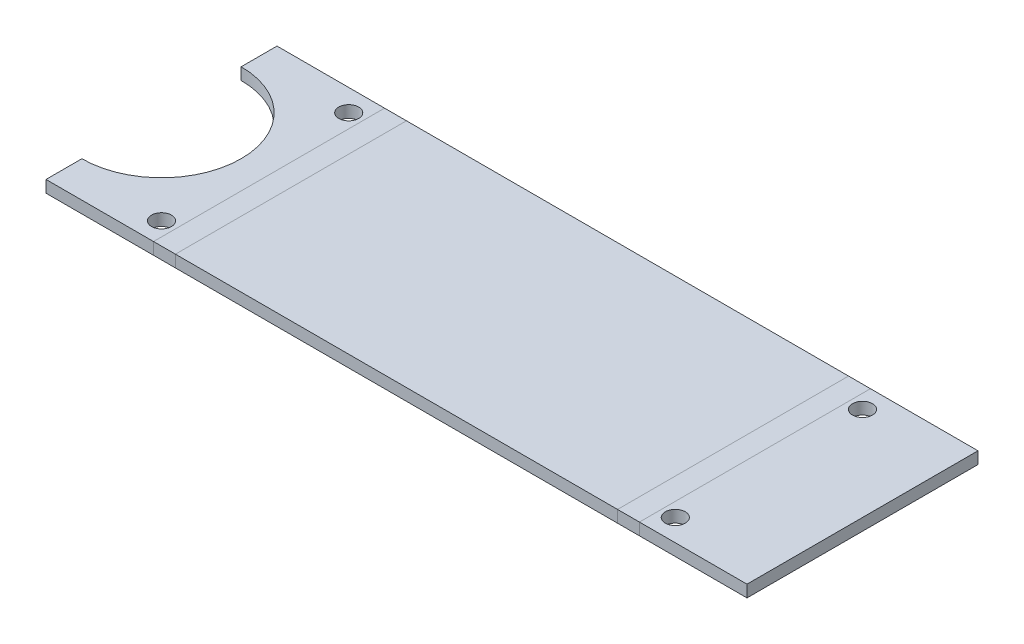
ISO-10303-21;
HEADER;
FILE_DESCRIPTION(('STEP AP214'),'2;1');
FILE_NAME('part.step','',(''),(''),'','','');
FILE_SCHEMA(('AUTOMOTIVE_DESIGN { 1 0 10303 214 1 1 1 1 }'));
ENDSEC;
DATA;
#1=APPLICATION_CONTEXT('core data for automotive mechanical design processes');
#2=APPLICATION_PROTOCOL_DEFINITION('international standard','automotive_design',2000,#1);
#3=PRODUCT_CONTEXT('',#1,'mechanical');
#4=PRODUCT('Part','Part','',(#3));
#5=PRODUCT_RELATED_PRODUCT_CATEGORY('part','',(#4));
#6=PRODUCT_DEFINITION_FORMATION('','',#4);
#7=PRODUCT_DEFINITION_CONTEXT('part definition',#1,'design');
#8=PRODUCT_DEFINITION('design','',#6,#7);
#9=PRODUCT_DEFINITION_SHAPE('','',#8);
#10=(LENGTH_UNIT() NAMED_UNIT(*) SI_UNIT(.MILLI.,.METRE.));
#11=(NAMED_UNIT(*) PLANE_ANGLE_UNIT() SI_UNIT($,.RADIAN.));
#12=(NAMED_UNIT(*) SI_UNIT($,.STERADIAN.) SOLID_ANGLE_UNIT());
#13=UNCERTAINTY_MEASURE_WITH_UNIT(LENGTH_MEASURE(1.E-05),#10,'distance_accuracy_value','');
#14=(GEOMETRIC_REPRESENTATION_CONTEXT(3) GLOBAL_UNCERTAINTY_ASSIGNED_CONTEXT((#13)) GLOBAL_UNIT_ASSIGNED_CONTEXT((#10,
#11,#12)) REPRESENTATION_CONTEXT('',''));
#15=CARTESIAN_POINT('',(0.,0.,0.));
#16=DIRECTION('',(0.,0.,1.));
#17=DIRECTION('',(1.,0.,0.));
#18=AXIS2_PLACEMENT_3D('',#15,#16,#17);
#19=CARTESIAN_POINT('',(0.,3.,0.));
#20=DIRECTION('',(0.,0.,-1.));
#21=DIRECTION('',(-1.,0.,0.));
#22=AXIS2_PLACEMENT_3D('',#19,#20,#21);
#23=PLANE('',#22);
#24=DIRECTION('',(0.,1.,0.));
#25=VECTOR('',#24,1.);
#26=CARTESIAN_POINT('',(116.,3.,0.));
#27=LINE('',#26,#25);
#28=CARTESIAN_POINT('',(116.,0.,0.));
#29=VERTEX_POINT('',#28);
#30=CARTESIAN_POINT('',(116.,3.,0.));
#31=VERTEX_POINT('',#30);
#32=EDGE_CURVE('E11',#29,#31,#27,.T.);
#33=ORIENTED_EDGE('',*,*,#32,.F.);
#34=DIRECTION('',(1.,0.,0.));
#35=VECTOR('',#34,1.);
#36=CARTESIAN_POINT('',(0.,0.,0.));
#37=LINE('',#36,#35);
#38=CARTESIAN_POINT('',(5.,0.,0.));
#39=VERTEX_POINT('',#38);
#40=EDGE_CURVE('E53',#29,#39,#37,.F.);
#41=ORIENTED_EDGE('',*,*,#40,.T.);
#42=DIRECTION('',(0.,1.,0.));
#43=VECTOR('',#42,1.);
#44=CARTESIAN_POINT('',(5.,3.,0.));
#45=LINE('',#44,#43);
#46=CARTESIAN_POINT('',(5.,3.,0.));
#47=VERTEX_POINT('',#46);
#48=EDGE_CURVE('E289',#39,#47,#45,.T.);
#49=ORIENTED_EDGE('',*,*,#48,.T.);
#50=DIRECTION('',(-1.,0.,0.));
#51=VECTOR('',#50,1.);
#52=CARTESIAN_POINT('',(0.,3.,0.));
#53=LINE('',#52,#51);
#54=EDGE_CURVE('E284',#31,#47,#53,.T.);
#55=ORIENTED_EDGE('',*,*,#54,.F.);
#56=EDGE_LOOP('',(#33,#41,#49,#55));
#57=FACE_BOUND('',#56,.T.);
#58=ADVANCED_FACE('F39',(#57),#23,.T.);
#59=CARTESIAN_POINT('',(0.,3.,58.));
#60=DIRECTION('',(0.,0.,1.));
#61=DIRECTION('',(1.,0.,0.));
#62=AXIS2_PLACEMENT_3D('',#59,#60,#61);
#63=PLANE('',#62);
#64=DIRECTION('',(0.,1.,0.));
#65=VECTOR('',#64,1.);
#66=CARTESIAN_POINT('',(5.,3.,58.));
#67=LINE('',#66,#65);
#68=CARTESIAN_POINT('',(5.,0.,58.));
#69=VERTEX_POINT('',#68);
#70=CARTESIAN_POINT('',(5.,3.,58.));
#71=VERTEX_POINT('',#70);
#72=EDGE_CURVE('E295',#69,#71,#67,.T.);
#73=ORIENTED_EDGE('',*,*,#72,.F.);
#74=DIRECTION('',(1.,0.,0.));
#75=VECTOR('',#74,1.);
#76=CARTESIAN_POINT('',(0.,0.,58.));
#77=LINE('',#76,#75);
#78=CARTESIAN_POINT('',(116.,0.,58.));
#79=VERTEX_POINT('',#78);
#80=EDGE_CURVE('E61',#69,#79,#77,.T.);
#81=ORIENTED_EDGE('',*,*,#80,.T.);
#82=DIRECTION('',(0.,1.,0.));
#83=VECTOR('',#82,1.);
#84=CARTESIAN_POINT('',(116.,3.,58.));
#85=LINE('',#84,#83);
#86=CARTESIAN_POINT('',(116.,3.,58.));
#87=VERTEX_POINT('',#86);
#88=EDGE_CURVE('E300',#79,#87,#85,.T.);
#89=ORIENTED_EDGE('',*,*,#88,.T.);
#90=DIRECTION('',(1.,0.,0.));
#91=VECTOR('',#90,1.);
#92=CARTESIAN_POINT('',(0.,3.,58.));
#93=LINE('',#92,#91);
#94=EDGE_CURVE('E282',#71,#87,#93,.T.);
#95=ORIENTED_EDGE('',*,*,#94,.F.);
#96=EDGE_LOOP('',(#73,#81,#89,#95));
#97=FACE_BOUND('',#96,.T.);
#98=ADVANCED_FACE('F324',(#97),#63,.T.);
#99=CARTESIAN_POINT('',(0.,3.,0.));
#100=DIRECTION('',(0.,1.,0.));
#101=DIRECTION('',(0.,0.,1.));
#102=AXIS2_PLACEMENT_3D('',#99,#100,#101);
#103=PLANE('',#102);
#104=ORIENTED_EDGE('',*,*,#54,.T.);
#105=DIRECTION('',(0.,0.,1.));
#106=VECTOR('',#105,1.);
#107=CARTESIAN_POINT('',(5.,3.,0.));
#108=LINE('',#107,#106);
#109=EDGE_CURVE('E287',#47,#71,#108,.T.);
#110=ORIENTED_EDGE('',*,*,#109,.T.);
#111=ORIENTED_EDGE('',*,*,#94,.T.);
#112=DIRECTION('',(0.,0.,-1.));
#113=VECTOR('',#112,1.);
#114=CARTESIAN_POINT('',(116.,3.,0.));
#115=LINE('',#114,#113);
#116=EDGE_CURVE('E298',#87,#31,#115,.T.);
#117=ORIENTED_EDGE('',*,*,#116,.T.);
#118=EDGE_LOOP('',(#104,#110,#111,#117));
#119=FACE_BOUND('',#118,.T.);
#120=ADVANCED_FACE('F327',(#119),#103,.T.);
#121=CARTESIAN_POINT('',(0.,0.,0.));
#122=DIRECTION('',(0.,1.,0.));
#123=DIRECTION('',(0.,0.,1.));
#124=AXIS2_PLACEMENT_3D('',#121,#122,#123);
#125=PLANE('',#124);
#126=ORIENTED_EDGE('',*,*,#40,.F.);
#127=DIRECTION('',(0.,0.,-1.));
#128=VECTOR('',#127,1.);
#129=CARTESIAN_POINT('',(116.,0.,0.));
#130=LINE('',#129,#128);
#131=EDGE_CURVE('E46',#79,#29,#130,.T.);
#132=ORIENTED_EDGE('',*,*,#131,.F.);
#133=ORIENTED_EDGE('',*,*,#80,.F.);
#134=DIRECTION('',(0.,0.,1.));
#135=VECTOR('',#134,1.);
#136=CARTESIAN_POINT('',(5.,0.,0.));
#137=LINE('',#136,#135);
#138=EDGE_CURVE('E292',#39,#69,#137,.T.);
#139=ORIENTED_EDGE('',*,*,#138,.F.);
#140=EDGE_LOOP('',(#126,#132,#133,#139));
#141=FACE_BOUND('',#140,.T.);
#142=ADVANCED_FACE('F372',(#141),#125,.F.);
#143=CARTESIAN_POINT('',(-0.497787143782165,3.,58.));
#144=DIRECTION('',(0.,0.,1.));
#145=DIRECTION('',(1.,0.,0.));
#146=AXIS2_PLACEMENT_3D('',#143,#144,#145);
#147=PLANE('',#146);
#148=DIRECTION('',(0.,1.,0.));
#149=VECTOR('',#148,1.);
#150=CARTESIAN_POINT('',(-0.497787143782138,3.,58.));
#151=LINE('',#150,#149);
#152=CARTESIAN_POINT('',(-0.497787143782138,0.,58.));
#153=VERTEX_POINT('',#152);
#154=CARTESIAN_POINT('',(-0.497787143782138,3.,58.));
#155=VERTEX_POINT('',#154);
#156=EDGE_CURVE('E206',#153,#155,#151,.T.);
#157=ORIENTED_EDGE('',*,*,#156,.F.);
#158=DIRECTION('',(1.,0.,0.));
#159=VECTOR('',#158,1.);
#160=CARTESIAN_POINT('',(2.25110642810893,0.,58.));
#161=LINE('',#160,#159);
#162=EDGE_CURVE('E209',#153,#69,#161,.T.);
#163=ORIENTED_EDGE('',*,*,#162,.T.);
#164=ORIENTED_EDGE('',*,*,#72,.T.);
#165=DIRECTION('',(1.,0.,0.));
#166=VECTOR('',#165,1.);
#167=CARTESIAN_POINT('',(-0.497787143782165,3.,58.));
#168=LINE('',#167,#166);
#169=EDGE_CURVE('E266',#155,#71,#168,.T.);
#170=ORIENTED_EDGE('',*,*,#169,.F.);
#171=EDGE_LOOP('',(#157,#163,#164,#170));
#172=FACE_BOUND('',#171,.T.);
#173=ADVANCED_FACE('F369',(#172),#147,.T.);
#174=CARTESIAN_POINT('',(5.,3.,0.));
#175=DIRECTION('',(0.,0.,-1.));
#176=DIRECTION('',(-1.,0.,0.));
#177=AXIS2_PLACEMENT_3D('',#174,#175,#176);
#178=PLANE('',#177);
#179=ORIENTED_EDGE('',*,*,#48,.F.);
#180=DIRECTION('',(1.,0.,0.));
#181=VECTOR('',#180,1.);
#182=CARTESIAN_POINT('',(2.25110642810893,0.,0.));
#183=LINE('',#182,#181);
#184=CARTESIAN_POINT('',(-0.497787143782148,0.,0.));
#185=VERTEX_POINT('',#184);
#186=EDGE_CURVE('E270',#39,#185,#183,.F.);
#187=ORIENTED_EDGE('',*,*,#186,.T.);
#188=DIRECTION('',(0.,1.,0.));
#189=VECTOR('',#188,1.);
#190=CARTESIAN_POINT('',(-0.497787143782138,3.,0.));
#191=LINE('',#190,#189);
#192=CARTESIAN_POINT('',(-0.497787143782165,3.,0.));
#193=VERTEX_POINT('',#192);
#194=EDGE_CURVE('E261',#185,#193,#191,.T.);
#195=ORIENTED_EDGE('',*,*,#194,.T.);
#196=DIRECTION('',(-1.,0.,0.));
#197=VECTOR('',#196,1.);
#198=CARTESIAN_POINT('',(5.,3.,0.));
#199=LINE('',#198,#197);
#200=EDGE_CURVE('E269',#47,#193,#199,.T.);
#201=ORIENTED_EDGE('',*,*,#200,.F.);
#202=EDGE_LOOP('',(#179,#187,#195,#201));
#203=FACE_BOUND('',#202,.T.);
#204=ADVANCED_FACE('F338',(#203),#178,.T.);
#205=CARTESIAN_POINT('',(2.25110642810893,3.,29.));
#206=DIRECTION('',(0.,1.,0.));
#207=DIRECTION('',(0.,0.,1.));
#208=AXIS2_PLACEMENT_3D('',#205,#206,#207);
#209=PLANE('',#208);
#210=ORIENTED_EDGE('',*,*,#200,.T.);
#211=DIRECTION('',(0.,0.,-1.));
#212=VECTOR('',#211,1.);
#213=CARTESIAN_POINT('',(-0.497787143782131,3.,0.));
#214=LINE('',#213,#212);
#215=EDGE_CURVE('E230',#155,#193,#214,.T.);
#216=ORIENTED_EDGE('',*,*,#215,.F.);
#217=ORIENTED_EDGE('',*,*,#169,.T.);
#218=ORIENTED_EDGE('',*,*,#109,.F.);
#219=EDGE_LOOP('',(#210,#216,#217,#218));
#220=FACE_BOUND('',#219,.T.);
#221=ADVANCED_FACE('F335',(#220),#209,.T.);
#222=CARTESIAN_POINT('',(2.25110642810893,0.,29.));
#223=DIRECTION('',(0.,1.,0.));
#224=DIRECTION('',(0.,0.,1.));
#225=AXIS2_PLACEMENT_3D('',#222,#223,#224);
#226=PLANE('',#225);
#227=ORIENTED_EDGE('',*,*,#186,.F.);
#228=ORIENTED_EDGE('',*,*,#138,.T.);
#229=ORIENTED_EDGE('',*,*,#162,.F.);
#230=DIRECTION('',(0.,0.,-1.));
#231=VECTOR('',#230,1.);
#232=CARTESIAN_POINT('',(-0.497787143782138,0.,0.));
#233=LINE('',#232,#231);
#234=EDGE_CURVE('E201',#153,#185,#233,.T.);
#235=ORIENTED_EDGE('',*,*,#234,.T.);
#236=EDGE_LOOP('',(#227,#228,#229,#235));
#237=FACE_BOUND('',#236,.T.);
#238=ADVANCED_FACE('F371',(#237),#226,.F.);
#239=CARTESIAN_POINT('',(-27.4977871437821,3.,0.));
#240=DIRECTION('',(-1.,0.,0.));
#241=DIRECTION('',(0.,0.,-1.));
#242=AXIS2_PLACEMENT_3D('',#239,#240,#241);
#243=PLANE('',#242);
#244=DIRECTION('',(0.,1.,0.));
#245=VECTOR('',#244,1.);
#246=CARTESIAN_POINT('',(-27.4977871437821,3.00000000000001,49.));
#247=LINE('',#246,#245);
#248=CARTESIAN_POINT('',(-27.4977871437821,0.,49.));
#249=VERTEX_POINT('',#248);
#250=CARTESIAN_POINT('',(-27.4977871437821,3.00000000000001,49.));
#251=VERTEX_POINT('',#250);
#252=EDGE_CURVE('E254',#249,#251,#247,.T.);
#253=ORIENTED_EDGE('',*,*,#252,.F.);
#254=DIRECTION('',(0.,0.,1.));
#255=VECTOR('',#254,1.);
#256=CARTESIAN_POINT('',(-27.4977871437821,0.,0.));
#257=LINE('',#256,#255);
#258=CARTESIAN_POINT('',(-27.4977871437821,0.,58.));
#259=VERTEX_POINT('',#258);
#260=EDGE_CURVE('E217',#259,#249,#257,.F.);
#261=ORIENTED_EDGE('',*,*,#260,.F.);
#262=DIRECTION('',(0.,1.,0.));
#263=VECTOR('',#262,1.);
#264=CARTESIAN_POINT('',(-27.4977871437821,3.,58.));
#265=LINE('',#264,#263);
#266=CARTESIAN_POINT('',(-27.4977871437821,3.,58.));
#267=VERTEX_POINT('',#266);
#268=EDGE_CURVE('E259',#259,#267,#265,.T.);
#269=ORIENTED_EDGE('',*,*,#268,.T.);
#270=DIRECTION('',(0.,0.,-1.));
#271=VECTOR('',#270,1.);
#272=CARTESIAN_POINT('',(-27.4977871437821,3.,0.));
#273=LINE('',#272,#271);
#274=EDGE_CURVE('E252',#267,#251,#273,.T.);
#275=ORIENTED_EDGE('',*,*,#274,.T.);
#276=EDGE_LOOP('',(#253,#261,#269,#275));
#277=FACE_BOUND('',#276,.T.);
#278=ADVANCED_FACE('F360',(#277),#243,.T.);
#279=CARTESIAN_POINT('',(-27.4977871437821,3.,29.));
#280=DIRECTION('',(0.,-1.,0.));
#281=DIRECTION('',(0.,0.,1.));
#282=AXIS2_PLACEMENT_3D('',#279,#280,#281);
#283=CYLINDRICAL_SURFACE('',#282,20.);
#284=DIRECTION('',(0.,1.,0.));
#285=VECTOR('',#284,1.);
#286=CARTESIAN_POINT('',(-27.4977871437821,3.00000000000001,9.));
#287=LINE('',#286,#285);
#288=CARTESIAN_POINT('',(-27.4977871437821,0.,9.));
#289=VERTEX_POINT('',#288);
#290=CARTESIAN_POINT('',(-27.4977871437821,3.00000000000001,9.));
#291=VERTEX_POINT('',#290);
#292=EDGE_CURVE('E251',#289,#291,#287,.T.);
#293=ORIENTED_EDGE('',*,*,#292,.F.);
#294=CARTESIAN_POINT('',(-27.4977871437821,0.,29.));
#295=DIRECTION('',(0.,-1.,0.));
#296=DIRECTION('',(0.,0.,1.));
#297=AXIS2_PLACEMENT_3D('',#294,#295,#296);
#298=CIRCLE('',#297,20.);
#299=EDGE_CURVE('E256',#289,#249,#298,.T.);
#300=ORIENTED_EDGE('',*,*,#299,.T.);
#301=ORIENTED_EDGE('',*,*,#252,.T.);
#302=CARTESIAN_POINT('',(-27.4977871437821,3.,29.));
#303=DIRECTION('',(0.,-1.,0.));
#304=DIRECTION('',(0.,0.,1.));
#305=AXIS2_PLACEMENT_3D('',#302,#303,#304);
#306=CIRCLE('',#305,20.);
#307=EDGE_CURVE('E227',#291,#251,#306,.T.);
#308=ORIENTED_EDGE('',*,*,#307,.F.);
#309=EDGE_LOOP('',(#293,#300,#301,#308));
#310=FACE_BOUND('',#309,.T.);
#311=ADVANCED_FACE('F353',(#310),#283,.F.);
#312=DIRECTION('',(0.,1.,0.));
#313=VECTOR('',#312,1.);
#314=CARTESIAN_POINT('',(-27.4977871437821,3.,0.));
#315=LINE('',#314,#313);
#316=CARTESIAN_POINT('',(-27.4977871437821,0.,0.));
#317=VERTEX_POINT('',#316);
#318=CARTESIAN_POINT('',(-27.4977871437821,3.,0.));
#319=VERTEX_POINT('',#318);
#320=EDGE_CURVE('E223',#317,#319,#315,.T.);
#321=ORIENTED_EDGE('',*,*,#320,.F.);
#322=DIRECTION('',(0.,0.,1.));
#323=VECTOR('',#322,1.);
#324=CARTESIAN_POINT('',(-27.4977871437821,0.,0.));
#325=LINE('',#324,#323);
#326=EDGE_CURVE('E214',#289,#317,#325,.F.);
#327=ORIENTED_EDGE('',*,*,#326,.F.);
#328=ORIENTED_EDGE('',*,*,#292,.T.);
#329=EDGE_CURVE('E248',#291,#319,#273,.T.);
#330=ORIENTED_EDGE('',*,*,#329,.T.);
#331=EDGE_LOOP('',(#321,#327,#328,#330));
#332=FACE_BOUND('',#331,.T.);
#333=ADVANCED_FACE('F349',(#332),#243,.T.);
#334=CARTESIAN_POINT('',(-3.99778714378213,3.,5.5));
#335=DIRECTION('',(0.,-1.,0.));
#336=DIRECTION('',(0.,0.,1.));
#337=AXIS2_PLACEMENT_3D('',#334,#335,#336);
#338=CYLINDRICAL_SURFACE('',#337,2.5);
#339=CARTESIAN_POINT('',(-3.99778714378213,3.,5.5));
#340=DIRECTION('',(0.,-1.,0.));
#341=DIRECTION('',(0.,0.,1.));
#342=AXIS2_PLACEMENT_3D('',#339,#340,#341);
#343=CIRCLE('',#342,2.5);
#344=CARTESIAN_POINT('',(-3.99778714378213,3.,8.));
#345=VERTEX_POINT('',#344);
#346=EDGE_CURVE('E234',#345,#345,#343,.T.);
#347=ORIENTED_EDGE('',*,*,#346,.F.);
#348=EDGE_LOOP('',(#347));
#349=FACE_BOUND('',#348,.T.);
#350=CARTESIAN_POINT('',(-3.99778714378213,0.,5.5));
#351=DIRECTION('',(0.,-1.,0.));
#352=DIRECTION('',(0.,0.,1.));
#353=AXIS2_PLACEMENT_3D('',#350,#351,#352);
#354=CIRCLE('',#353,2.5);
#355=CARTESIAN_POINT('',(-3.99778714378213,0.,8.));
#356=VERTEX_POINT('',#355);
#357=EDGE_CURVE('E245',#356,#356,#354,.T.);
#358=ORIENTED_EDGE('',*,*,#357,.T.);
#359=EDGE_LOOP('',(#358));
#360=FACE_BOUND('',#359,.T.);
#361=ADVANCED_FACE('F428',(#349,#360),#338,.F.);
#362=CARTESIAN_POINT('',(-3.99778714378213,3.,52.5));
#363=DIRECTION('',(0.,-1.,0.));
#364=DIRECTION('',(0.,0.,1.));
#365=AXIS2_PLACEMENT_3D('',#362,#363,#364);
#366=CYLINDRICAL_SURFACE('',#365,2.5);
#367=CARTESIAN_POINT('',(-3.99778714378213,3.,52.5));
#368=DIRECTION('',(0.,-1.,0.));
#369=DIRECTION('',(0.,0.,1.));
#370=AXIS2_PLACEMENT_3D('',#367,#368,#369);
#371=CIRCLE('',#370,2.5);
#372=CARTESIAN_POINT('',(-3.99778714378213,3.,55.));
#373=VERTEX_POINT('',#372);
#374=EDGE_CURVE('E239',#373,#373,#371,.T.);
#375=ORIENTED_EDGE('',*,*,#374,.F.);
#376=EDGE_LOOP('',(#375));
#377=FACE_BOUND('',#376,.T.);
#378=CARTESIAN_POINT('',(-3.99778714378213,0.,52.5));
#379=DIRECTION('',(0.,-1.,0.));
#380=DIRECTION('',(0.,0.,1.));
#381=AXIS2_PLACEMENT_3D('',#378,#379,#380);
#382=CIRCLE('',#381,2.5);
#383=CARTESIAN_POINT('',(-3.99778714378213,0.,55.));
#384=VERTEX_POINT('',#383);
#385=EDGE_CURVE('E242',#384,#384,#382,.T.);
#386=ORIENTED_EDGE('',*,*,#385,.T.);
#387=EDGE_LOOP('',(#386));
#388=FACE_BOUND('',#387,.T.);
#389=ADVANCED_FACE('F437',(#377,#388),#366,.F.);
#390=CARTESIAN_POINT('',(-27.4977871437821,3.,0.));
#391=DIRECTION('',(0.,-1.,0.));
#392=DIRECTION('',(0.,0.,1.));
#393=AXIS2_PLACEMENT_3D('',#390,#391,#392);
#394=PLANE('',#393);
#395=ORIENTED_EDGE('',*,*,#374,.T.);
#396=EDGE_LOOP('',(#395));
#397=FACE_BOUND('',#396,.T.);
#398=ORIENTED_EDGE('',*,*,#346,.T.);
#399=EDGE_LOOP('',(#398));
#400=FACE_BOUND('',#399,.T.);
#401=DIRECTION('',(1.,0.,0.));
#402=VECTOR('',#401,1.);
#403=CARTESIAN_POINT('',(-27.4977871437821,3.,58.));
#404=LINE('',#403,#402);
#405=EDGE_CURVE('E232',#267,#155,#404,.T.);
#406=ORIENTED_EDGE('',*,*,#405,.T.);
#407=ORIENTED_EDGE('',*,*,#215,.T.);
#408=DIRECTION('',(1.,0.,0.));
#409=VECTOR('',#408,1.);
#410=CARTESIAN_POINT('',(-27.4977871437821,3.,0.));
#411=LINE('',#410,#409);
#412=EDGE_CURVE('E220',#319,#193,#411,.T.);
#413=ORIENTED_EDGE('',*,*,#412,.F.);
#414=ORIENTED_EDGE('',*,*,#329,.F.);
#415=ORIENTED_EDGE('',*,*,#307,.T.);
#416=ORIENTED_EDGE('',*,*,#274,.F.);
#417=EDGE_LOOP('',(#406,#407,#413,#414,#415,#416));
#418=FACE_BOUND('',#417,.T.);
#419=ADVANCED_FACE('F346',(#397,#400,#418),#394,.F.);
#420=CARTESIAN_POINT('',(-27.4977871437821,3.,0.));
#421=DIRECTION('',(0.,0.,-1.));
#422=DIRECTION('',(1.,0.,0.));
#423=AXIS2_PLACEMENT_3D('',#420,#421,#422);
#424=PLANE('',#423);
#425=ORIENTED_EDGE('',*,*,#194,.F.);
#426=DIRECTION('',(-1.,0.,0.));
#427=VECTOR('',#426,1.);
#428=CARTESIAN_POINT('',(-27.4977871437821,0.,0.));
#429=LINE('',#428,#427);
#430=EDGE_CURVE('E212',#317,#185,#429,.F.);
#431=ORIENTED_EDGE('',*,*,#430,.F.);
#432=ORIENTED_EDGE('',*,*,#320,.T.);
#433=ORIENTED_EDGE('',*,*,#412,.T.);
#434=EDGE_LOOP('',(#425,#431,#432,#433));
#435=FACE_BOUND('',#434,.T.);
#436=ADVANCED_FACE('F342',(#435),#424,.T.);
#437=CARTESIAN_POINT('',(-27.4977871437821,0.,0.));
#438=DIRECTION('',(0.,-1.,0.));
#439=DIRECTION('',(0.,0.,1.));
#440=AXIS2_PLACEMENT_3D('',#437,#438,#439);
#441=PLANE('',#440);
#442=ORIENTED_EDGE('',*,*,#385,.F.);
#443=EDGE_LOOP('',(#442));
#444=FACE_BOUND('',#443,.T.);
#445=ORIENTED_EDGE('',*,*,#357,.F.);
#446=EDGE_LOOP('',(#445));
#447=FACE_BOUND('',#446,.T.);
#448=DIRECTION('',(-1.,0.,0.));
#449=VECTOR('',#448,1.);
#450=CARTESIAN_POINT('',(-27.4977871437821,0.,58.));
#451=LINE('',#450,#449);
#452=EDGE_CURVE('E210',#259,#153,#451,.F.);
#453=ORIENTED_EDGE('',*,*,#452,.F.);
#454=ORIENTED_EDGE('',*,*,#260,.T.);
#455=ORIENTED_EDGE('',*,*,#299,.F.);
#456=ORIENTED_EDGE('',*,*,#326,.T.);
#457=ORIENTED_EDGE('',*,*,#430,.T.);
#458=ORIENTED_EDGE('',*,*,#234,.F.);
#459=EDGE_LOOP('',(#453,#454,#455,#456,#457,#458));
#460=FACE_BOUND('',#459,.T.);
#461=ADVANCED_FACE('F356',(#444,#447,#460),#441,.T.);
#462=CARTESIAN_POINT('',(-27.4977871437821,3.,58.));
#463=DIRECTION('',(0.,0.,-1.));
#464=DIRECTION('',(1.,0.,0.));
#465=AXIS2_PLACEMENT_3D('',#462,#463,#464);
#466=PLANE('',#465);
#467=ORIENTED_EDGE('',*,*,#268,.F.);
#468=ORIENTED_EDGE('',*,*,#452,.T.);
#469=ORIENTED_EDGE('',*,*,#156,.T.);
#470=ORIENTED_EDGE('',*,*,#405,.F.);
#471=EDGE_LOOP('',(#467,#468,#469,#470));
#472=FACE_BOUND('',#471,.T.);
#473=ADVANCED_FACE('F365',(#472),#466,.F.);
#474=CARTESIAN_POINT('',(121.497787143782,3.,0.));
#475=DIRECTION('',(0.,0.,-1.));
#476=DIRECTION('',(-1.,0.,0.));
#477=AXIS2_PLACEMENT_3D('',#474,#475,#476);
#478=PLANE('',#477);
#479=DIRECTION('',(0.,1.,0.));
#480=VECTOR('',#479,1.);
#481=CARTESIAN_POINT('',(121.497787143782,3.,0.));
#482=LINE('',#481,#480);
#483=CARTESIAN_POINT('',(121.497787143782,0.,0.));
#484=VERTEX_POINT('',#483);
#485=CARTESIAN_POINT('',(121.497787143782,3.,0.));
#486=VERTEX_POINT('',#485);
#487=EDGE_CURVE('E166',#484,#486,#482,.T.);
#488=ORIENTED_EDGE('',*,*,#487,.F.);
#489=DIRECTION('',(1.,0.,0.));
#490=VECTOR('',#489,1.);
#491=CARTESIAN_POINT('',(118.748893571891,0.,0.));
#492=LINE('',#491,#490);
#493=EDGE_CURVE('E168',#484,#29,#492,.F.);
#494=ORIENTED_EDGE('',*,*,#493,.T.);
#495=ORIENTED_EDGE('',*,*,#32,.T.);
#496=DIRECTION('',(-1.,0.,0.));
#497=VECTOR('',#496,1.);
#498=CARTESIAN_POINT('',(121.497787143782,3.,0.));
#499=LINE('',#498,#497);
#500=EDGE_CURVE('E194',#486,#31,#499,.T.);
#501=ORIENTED_EDGE('',*,*,#500,.F.);
#502=EDGE_LOOP('',(#488,#494,#495,#501));
#503=FACE_BOUND('',#502,.T.);
#504=ADVANCED_FACE('F308',(#503),#478,.T.);
#505=CARTESIAN_POINT('',(116.,3.,58.));
#506=DIRECTION('',(0.,0.,1.));
#507=DIRECTION('',(1.,0.,0.));
#508=AXIS2_PLACEMENT_3D('',#505,#506,#507);
#509=PLANE('',#508);
#510=ORIENTED_EDGE('',*,*,#88,.F.);
#511=DIRECTION('',(1.,0.,0.));
#512=VECTOR('',#511,1.);
#513=CARTESIAN_POINT('',(118.748893571891,0.,58.));
#514=LINE('',#513,#512);
#515=CARTESIAN_POINT('',(121.497787143782,0.,58.));
#516=VERTEX_POINT('',#515);
#517=EDGE_CURVE('E198',#79,#516,#514,.T.);
#518=ORIENTED_EDGE('',*,*,#517,.T.);
#519=DIRECTION('',(0.,1.,0.));
#520=VECTOR('',#519,1.);
#521=CARTESIAN_POINT('',(121.497787143782,3.,58.));
#522=LINE('',#521,#520);
#523=CARTESIAN_POINT('',(121.497787143782,3.,58.));
#524=VERTEX_POINT('',#523);
#525=EDGE_CURVE('E151',#516,#524,#522,.T.);
#526=ORIENTED_EDGE('',*,*,#525,.T.);
#527=DIRECTION('',(1.,0.,0.));
#528=VECTOR('',#527,1.);
#529=CARTESIAN_POINT('',(116.,3.,58.));
#530=LINE('',#529,#528);
#531=EDGE_CURVE('E197',#87,#524,#530,.T.);
#532=ORIENTED_EDGE('',*,*,#531,.F.);
#533=EDGE_LOOP('',(#510,#518,#526,#532));
#534=FACE_BOUND('',#533,.T.);
#535=ADVANCED_FACE('F322',(#534),#509,.T.);
#536=CARTESIAN_POINT('',(118.748893571891,3.,29.));
#537=DIRECTION('',(0.,1.,0.));
#538=DIRECTION('',(0.,0.,1.));
#539=AXIS2_PLACEMENT_3D('',#536,#537,#538);
#540=PLANE('',#539);
#541=ORIENTED_EDGE('',*,*,#531,.T.);
#542=DIRECTION('',(0.,0.,1.));
#543=VECTOR('',#542,1.);
#544=CARTESIAN_POINT('',(121.497787143782,3.,0.));
#545=LINE('',#544,#543);
#546=EDGE_CURVE('E175',#486,#524,#545,.T.);
#547=ORIENTED_EDGE('',*,*,#546,.F.);
#548=ORIENTED_EDGE('',*,*,#500,.T.);
#549=ORIENTED_EDGE('',*,*,#116,.F.);
#550=EDGE_LOOP('',(#541,#547,#548,#549));
#551=FACE_BOUND('',#550,.T.);
#552=ADVANCED_FACE('F313',(#551),#540,.T.);
#553=CARTESIAN_POINT('',(118.748893571891,0.,29.));
#554=DIRECTION('',(0.,1.,0.));
#555=DIRECTION('',(0.,0.,1.));
#556=AXIS2_PLACEMENT_3D('',#553,#554,#555);
#557=PLANE('',#556);
#558=ORIENTED_EDGE('',*,*,#517,.F.);
#559=ORIENTED_EDGE('',*,*,#131,.T.);
#560=ORIENTED_EDGE('',*,*,#493,.F.);
#561=DIRECTION('',(0.,0.,1.));
#562=VECTOR('',#561,1.);
#563=CARTESIAN_POINT('',(121.497787143782,0.,0.));
#564=LINE('',#563,#562);
#565=EDGE_CURVE('E164',#484,#516,#564,.T.);
#566=ORIENTED_EDGE('',*,*,#565,.T.);
#567=EDGE_LOOP('',(#558,#559,#560,#566));
#568=FACE_BOUND('',#567,.T.);
#569=ADVANCED_FACE('F305',(#568),#557,.F.);
#570=CARTESIAN_POINT('',(148.497787143782,3.,0.));
#571=DIRECTION('',(1.,0.,0.));
#572=DIRECTION('',(0.,0.,1.));
#573=AXIS2_PLACEMENT_3D('',#570,#571,#572);
#574=PLANE('',#573);
#575=DIRECTION('',(0.,1.,0.));
#576=VECTOR('',#575,1.);
#577=CARTESIAN_POINT('',(148.497787143782,3.,58.));
#578=LINE('',#577,#576);
#579=CARTESIAN_POINT('',(148.497787143782,0.,58.));
#580=VERTEX_POINT('',#579);
#581=CARTESIAN_POINT('',(148.497787143782,3.,58.));
#582=VERTEX_POINT('',#581);
#583=EDGE_CURVE('E156',#580,#582,#578,.T.);
#584=ORIENTED_EDGE('',*,*,#583,.F.);
#585=DIRECTION('',(0.,0.,-1.));
#586=VECTOR('',#585,1.);
#587=CARTESIAN_POINT('',(148.497787143782,0.,0.));
#588=LINE('',#587,#586);
#589=CARTESIAN_POINT('',(148.497787143782,0.,0.));
#590=VERTEX_POINT('',#589);
#591=EDGE_CURVE('E154',#590,#580,#588,.F.);
#592=ORIENTED_EDGE('',*,*,#591,.F.);
#593=DIRECTION('',(0.,1.,0.));
#594=VECTOR('',#593,1.);
#595=CARTESIAN_POINT('',(148.497787143782,3.,0.));
#596=LINE('',#595,#594);
#597=CARTESIAN_POINT('',(148.497787143782,3.,0.));
#598=VERTEX_POINT('',#597);
#599=EDGE_CURVE('E139',#590,#598,#596,.T.);
#600=ORIENTED_EDGE('',*,*,#599,.T.);
#601=DIRECTION('',(0.,0.,1.));
#602=VECTOR('',#601,1.);
#603=CARTESIAN_POINT('',(148.497787143782,3.,0.));
#604=LINE('',#603,#602);
#605=EDGE_CURVE('E150',#598,#582,#604,.T.);
#606=ORIENTED_EDGE('',*,*,#605,.T.);
#607=EDGE_LOOP('',(#584,#592,#600,#606));
#608=FACE_BOUND('',#607,.T.);
#609=ADVANCED_FACE('F155',(#608),#574,.T.);
#610=CARTESIAN_POINT('',(124.997787143782,3.,52.5));
#611=DIRECTION('',(0.,-1.,0.));
#612=DIRECTION('',(0.,0.,-1.));
#613=AXIS2_PLACEMENT_3D('',#610,#611,#612);
#614=CYLINDRICAL_SURFACE('',#613,2.5);
#615=CARTESIAN_POINT('',(124.997787143782,3.,52.5));
#616=DIRECTION('',(0.,-1.,0.));
#617=DIRECTION('',(0.,0.,-1.));
#618=AXIS2_PLACEMENT_3D('',#615,#616,#617);
#619=CIRCLE('',#618,2.5);
#620=CARTESIAN_POINT('',(124.997787143782,3.,50.));
#621=VERTEX_POINT('',#620);
#622=EDGE_CURVE('E178',#621,#621,#619,.T.);
#623=ORIENTED_EDGE('',*,*,#622,.F.);
#624=EDGE_LOOP('',(#623));
#625=FACE_BOUND('',#624,.T.);
#626=CARTESIAN_POINT('',(124.997787143782,0.,52.5));
#627=DIRECTION('',(0.,-1.,0.));
#628=DIRECTION('',(0.,0.,-1.));
#629=AXIS2_PLACEMENT_3D('',#626,#627,#628);
#630=CIRCLE('',#629,2.5);
#631=CARTESIAN_POINT('',(124.997787143782,0.,50.));
#632=VERTEX_POINT('',#631);
#633=EDGE_CURVE('E187',#632,#632,#630,.T.);
#634=ORIENTED_EDGE('',*,*,#633,.T.);
#635=EDGE_LOOP('',(#634));
#636=FACE_BOUND('',#635,.T.);
#637=ADVANCED_FACE('F497',(#625,#636),#614,.F.);
#638=CARTESIAN_POINT('',(124.997787143782,3.,5.50000000000002));
#639=DIRECTION('',(0.,-1.,0.));
#640=DIRECTION('',(0.,0.,-1.));
#641=AXIS2_PLACEMENT_3D('',#638,#639,#640);
#642=CYLINDRICAL_SURFACE('',#641,2.5);
#643=CARTESIAN_POINT('',(124.997787143782,3.,5.50000000000002));
#644=DIRECTION('',(0.,-1.,0.));
#645=DIRECTION('',(0.,0.,-1.));
#646=AXIS2_PLACEMENT_3D('',#643,#644,#645);
#647=CIRCLE('',#646,2.5);
#648=CARTESIAN_POINT('',(124.997787143782,3.,3.00000000000002));
#649=VERTEX_POINT('',#648);
#650=EDGE_CURVE('E181',#649,#649,#647,.T.);
#651=ORIENTED_EDGE('',*,*,#650,.F.);
#652=EDGE_LOOP('',(#651));
#653=FACE_BOUND('',#652,.T.);
#654=CARTESIAN_POINT('',(124.997787143782,0.,5.50000000000002));
#655=DIRECTION('',(0.,-1.,0.));
#656=DIRECTION('',(0.,0.,-1.));
#657=AXIS2_PLACEMENT_3D('',#654,#655,#656);
#658=CIRCLE('',#657,2.5);
#659=CARTESIAN_POINT('',(124.997787143782,0.,3.00000000000002));
#660=VERTEX_POINT('',#659);
#661=EDGE_CURVE('E184',#660,#660,#658,.T.);
#662=ORIENTED_EDGE('',*,*,#661,.T.);
#663=EDGE_LOOP('',(#662));
#664=FACE_BOUND('',#663,.T.);
#665=ADVANCED_FACE('F509',(#653,#664),#642,.F.);
#666=CARTESIAN_POINT('',(148.497787143782,3.,0.));
#667=DIRECTION('',(0.,-1.,0.));
#668=DIRECTION('',(0.,0.,-1.));
#669=AXIS2_PLACEMENT_3D('',#666,#667,#668);
#670=PLANE('',#669);
#671=ORIENTED_EDGE('',*,*,#650,.T.);
#672=EDGE_LOOP('',(#671));
#673=FACE_BOUND('',#672,.T.);
#674=ORIENTED_EDGE('',*,*,#622,.T.);
#675=EDGE_LOOP('',(#674));
#676=FACE_BOUND('',#675,.T.);
#677=DIRECTION('',(-1.,0.,0.));
#678=VECTOR('',#677,1.);
#679=CARTESIAN_POINT('',(148.497787143782,3.,0.));
#680=LINE('',#679,#678);
#681=EDGE_CURVE('E146',#598,#486,#680,.T.);
#682=ORIENTED_EDGE('',*,*,#681,.T.);
#683=ORIENTED_EDGE('',*,*,#546,.T.);
#684=DIRECTION('',(-1.,0.,0.));
#685=VECTOR('',#684,1.);
#686=CARTESIAN_POINT('',(148.497787143782,3.,58.));
#687=LINE('',#686,#685);
#688=EDGE_CURVE('E160',#582,#524,#687,.T.);
#689=ORIENTED_EDGE('',*,*,#688,.F.);
#690=ORIENTED_EDGE('',*,*,#605,.F.);
#691=EDGE_LOOP('',(#682,#683,#689,#690));
#692=FACE_BOUND('',#691,.T.);
#693=ADVANCED_FACE('F317',(#673,#676,#692),#670,.F.);
#694=CARTESIAN_POINT('',(148.497787143782,3.,58.));
#695=DIRECTION('',(0.,0.,1.));
#696=DIRECTION('',(-1.,0.,0.));
#697=AXIS2_PLACEMENT_3D('',#694,#695,#696);
#698=PLANE('',#697);
#699=ORIENTED_EDGE('',*,*,#525,.F.);
#700=DIRECTION('',(1.,0.,0.));
#701=VECTOR('',#700,1.);
#702=CARTESIAN_POINT('',(148.497787143782,0.,58.));
#703=LINE('',#702,#701);
#704=EDGE_CURVE('E159',#580,#516,#703,.F.);
#705=ORIENTED_EDGE('',*,*,#704,.F.);
#706=ORIENTED_EDGE('',*,*,#583,.T.);
#707=ORIENTED_EDGE('',*,*,#688,.T.);
#708=EDGE_LOOP('',(#699,#705,#706,#707));
#709=FACE_BOUND('',#708,.T.);
#710=ADVANCED_FACE('F320',(#709),#698,.T.);
#711=CARTESIAN_POINT('',(148.497787143782,0.,0.));
#712=DIRECTION('',(0.,-1.,0.));
#713=DIRECTION('',(0.,0.,-1.));
#714=AXIS2_PLACEMENT_3D('',#711,#712,#713);
#715=PLANE('',#714);
#716=ORIENTED_EDGE('',*,*,#661,.F.);
#717=EDGE_LOOP('',(#716));
#718=FACE_BOUND('',#717,.T.);
#719=ORIENTED_EDGE('',*,*,#633,.F.);
#720=EDGE_LOOP('',(#719));
#721=FACE_BOUND('',#720,.T.);
#722=DIRECTION('',(1.,0.,0.));
#723=VECTOR('',#722,1.);
#724=CARTESIAN_POINT('',(148.497787143782,0.,0.));
#725=LINE('',#724,#723);
#726=EDGE_CURVE('E144',#590,#484,#725,.F.);
#727=ORIENTED_EDGE('',*,*,#726,.F.);
#728=ORIENTED_EDGE('',*,*,#591,.T.);
#729=ORIENTED_EDGE('',*,*,#704,.T.);
#730=ORIENTED_EDGE('',*,*,#565,.F.);
#731=EDGE_LOOP('',(#727,#728,#729,#730));
#732=FACE_BOUND('',#731,.T.);
#733=ADVANCED_FACE('F162',(#718,#721,#732),#715,.T.);
#734=CARTESIAN_POINT('',(148.497787143782,3.,0.));
#735=DIRECTION('',(0.,0.,1.));
#736=DIRECTION('',(-1.,0.,0.));
#737=AXIS2_PLACEMENT_3D('',#734,#735,#736);
#738=PLANE('',#737);
#739=ORIENTED_EDGE('',*,*,#599,.F.);
#740=ORIENTED_EDGE('',*,*,#726,.T.);
#741=ORIENTED_EDGE('',*,*,#487,.T.);
#742=ORIENTED_EDGE('',*,*,#681,.F.);
#743=EDGE_LOOP('',(#739,#740,#741,#742));
#744=FACE_BOUND('',#743,.T.);
#745=ADVANCED_FACE('F141',(#744),#738,.F.);
#746=CLOSED_SHELL('',(#58,#98,#120,#142,#173,#204,#221,#238,#278,#311,#333,#361,#389,#419,#436,
#461,#473,#504,#535,#552,#569,#609,#637,#665,#693,#710,#733,#745));
#747=MANIFOLD_SOLID_BREP('B2',#746);
#748=ADVANCED_BREP_SHAPE_REPRESENTATION('',(#18,#747),#14);
#749=SHAPE_DEFINITION_REPRESENTATION(#9,#748);
ENDSEC;
END-ISO-10303-21;
